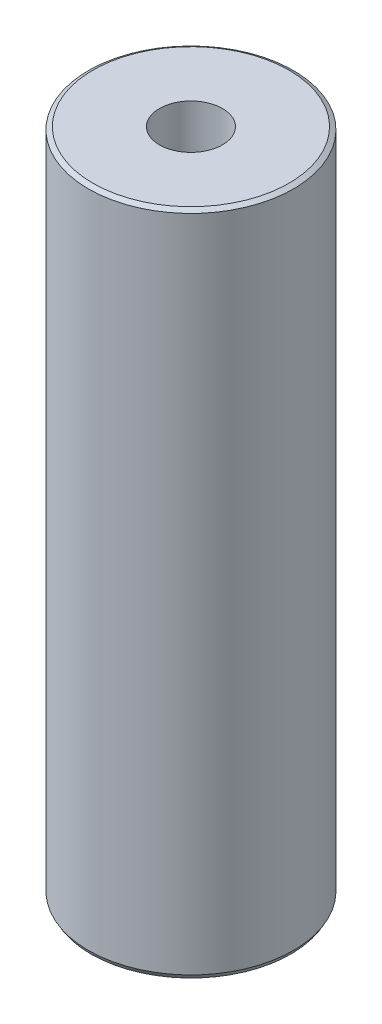
ISO-10303-21;
HEADER;
FILE_DESCRIPTION(('STEP AP214'),'2;1');
FILE_NAME('part.step','',(''),(''),'','','');
FILE_SCHEMA(('AUTOMOTIVE_DESIGN { 1 0 10303 214 1 1 1 1 }'));
ENDSEC;
DATA;
#1=APPLICATION_CONTEXT('core data for automotive mechanical design processes');
#2=APPLICATION_PROTOCOL_DEFINITION('international standard','automotive_design',2000,#1);
#3=PRODUCT_CONTEXT('',#1,'mechanical');
#4=PRODUCT('Part','Part','',(#3));
#5=PRODUCT_RELATED_PRODUCT_CATEGORY('part','',(#4));
#6=PRODUCT_DEFINITION_FORMATION('','',#4);
#7=PRODUCT_DEFINITION_CONTEXT('part definition',#1,'design');
#8=PRODUCT_DEFINITION('design','',#6,#7);
#9=PRODUCT_DEFINITION_SHAPE('','',#8);
#10=(LENGTH_UNIT() NAMED_UNIT(*) SI_UNIT(.MILLI.,.METRE.));
#11=(NAMED_UNIT(*) PLANE_ANGLE_UNIT() SI_UNIT($,.RADIAN.));
#12=(NAMED_UNIT(*) SI_UNIT($,.STERADIAN.) SOLID_ANGLE_UNIT());
#13=UNCERTAINTY_MEASURE_WITH_UNIT(LENGTH_MEASURE(1.E-05),#10,'distance_accuracy_value','');
#14=(GEOMETRIC_REPRESENTATION_CONTEXT(3) GLOBAL_UNCERTAINTY_ASSIGNED_CONTEXT((#13)) GLOBAL_UNIT_ASSIGNED_CONTEXT((#10,
#11,#12)) REPRESENTATION_CONTEXT('',''));
#15=CARTESIAN_POINT('',(0.,0.,0.));
#16=DIRECTION('',(0.,0.,1.));
#17=DIRECTION('',(1.,0.,0.));
#18=AXIS2_PLACEMENT_3D('',#15,#16,#17);
#19=CARTESIAN_POINT('',(0.,373.817596217918,0.));
#20=DIRECTION('',(0.,-1.,0.));
#21=DIRECTION('',(0.,0.,-1.));
#22=AXIS2_PLACEMENT_3D('',#19,#20,#21);
#23=CYLINDRICAL_SURFACE('',#22,57.5);
#24=CARTESIAN_POINT('',(0.,372.342375010247,0.));
#25=DIRECTION('',(0.,1.,0.));
#26=DIRECTION('',(0.,0.,1.));
#27=AXIS2_PLACEMENT_3D('',#24,#25,#26);
#28=CIRCLE('',#27,57.5);
#29=CARTESIAN_POINT('',(0.,372.342375010247,57.5));
#30=VERTEX_POINT('',#29);
#31=EDGE_CURVE('E50',#30,#30,#28,.F.);
#32=ORIENTED_EDGE('',*,*,#31,.T.);
#33=EDGE_LOOP('',(#32));
#34=FACE_BOUND('',#33,.T.);
#35=CARTESIAN_POINT('',(0.,2.53860821486557,0.));
#36=DIRECTION('',(0.,1.,0.));
#37=DIRECTION('',(0.,0.,1.));
#38=AXIS2_PLACEMENT_3D('',#35,#36,#37);
#39=CIRCLE('',#38,57.5);
#40=CARTESIAN_POINT('',(0.,2.53860821486557,57.5));
#41=VERTEX_POINT('',#40);
#42=EDGE_CURVE('E51',#41,#41,#39,.T.);
#43=ORIENTED_EDGE('',*,*,#42,.T.);
#44=EDGE_LOOP('',(#43));
#45=FACE_BOUND('',#44,.T.);
#46=ADVANCED_FACE('F39',(#34,#45),#23,.T.);
#47=CARTESIAN_POINT('',(0.,373.817596217918,0.));
#48=DIRECTION('',(0.,1.,0.));
#49=DIRECTION('',(0.,0.,1.));
#50=AXIS2_PLACEMENT_3D('',#47,#48,#49);
#51=PLANE('',#50);
#52=CARTESIAN_POINT('',(0.,373.817596217918,0.));
#53=DIRECTION('',(0.,1.,0.));
#54=DIRECTION('',(0.,0.,1.));
#55=AXIS2_PLACEMENT_3D('',#52,#53,#54);
#56=CIRCLE('',#55,54.9613917851344);
#57=CARTESIAN_POINT('',(0.,373.817596217918,54.9613917851344));
#58=VERTEX_POINT('',#57);
#59=EDGE_CURVE('E54',#58,#58,#56,.T.);
#60=ORIENTED_EDGE('',*,*,#59,.T.);
#61=EDGE_LOOP('',(#60));
#62=FACE_BOUND('',#61,.T.);
#63=CARTESIAN_POINT('',(0.,373.817596217918,0.));
#64=DIRECTION('',(0.,1.,0.));
#65=DIRECTION('',(0.,0.,1.));
#66=AXIS2_PLACEMENT_3D('',#63,#64,#65);
#67=CIRCLE('',#66,17.6762777401789);
#68=CARTESIAN_POINT('',(0.,373.817596217918,17.6762777401789));
#69=VERTEX_POINT('',#68);
#70=EDGE_CURVE('E58',#69,#69,#67,.T.);
#71=ORIENTED_EDGE('',*,*,#70,.F.);
#72=EDGE_LOOP('',(#71));
#73=FACE_BOUND('',#72,.T.);
#74=ADVANCED_FACE('F69',(#62,#73),#51,.T.);
#75=CARTESIAN_POINT('',(0.,0.,0.));
#76=DIRECTION('',(0.,1.,0.));
#77=DIRECTION('',(0.,0.,1.));
#78=AXIS2_PLACEMENT_3D('',#75,#76,#77);
#79=PLANE('',#78);
#80=CARTESIAN_POINT('',(0.,0.,0.));
#81=DIRECTION('',(0.,1.,0.));
#82=DIRECTION('',(0.,0.,1.));
#83=AXIS2_PLACEMENT_3D('',#80,#81,#82);
#84=CIRCLE('',#83,56.024778792329);
#85=CARTESIAN_POINT('',(0.,0.,56.024778792329));
#86=VERTEX_POINT('',#85);
#87=EDGE_CURVE('E10',#86,#86,#84,.F.);
#88=ORIENTED_EDGE('',*,*,#87,.T.);
#89=EDGE_LOOP('',(#88));
#90=FACE_BOUND('',#89,.T.);
#91=CARTESIAN_POINT('',(0.,0.,0.));
#92=DIRECTION('',(0.,1.,0.));
#93=DIRECTION('',(0.,0.,1.));
#94=AXIS2_PLACEMENT_3D('',#91,#92,#93);
#95=CIRCLE('',#94,17.6762777401789);
#96=CARTESIAN_POINT('',(0.,0.,17.6762777401789));
#97=VERTEX_POINT('',#96);
#98=EDGE_CURVE('E63',#97,#97,#95,.T.);
#99=ORIENTED_EDGE('',*,*,#98,.T.);
#100=EDGE_LOOP('',(#99));
#101=FACE_BOUND('',#100,.T.);
#102=ADVANCED_FACE('F75',(#90,#101),#79,.F.);
#103=CARTESIAN_POINT('',(0.,373.817596217918,0.));
#104=DIRECTION('',(0.,-1.,0.));
#105=DIRECTION('',(0.,0.,-1.));
#106=AXIS2_PLACEMENT_3D('',#103,#104,#105);
#107=CYLINDRICAL_SURFACE('',#106,17.6762777401789);
#108=ORIENTED_EDGE('',*,*,#70,.T.);
#109=EDGE_LOOP('',(#108));
#110=FACE_BOUND('',#109,.T.);
#111=ORIENTED_EDGE('',*,*,#98,.F.);
#112=EDGE_LOOP('',(#111));
#113=FACE_BOUND('',#112,.T.);
#114=ADVANCED_FACE('F70',(#110,#113),#107,.F.);
#115=CARTESIAN_POINT('',(0.,373.817596217918,0.));
#116=DIRECTION('',(0.,-1.,0.));
#117=DIRECTION('',(0.,0.,-1.));
#118=AXIS2_PLACEMENT_3D('',#115,#116,#117);
#119=CONICAL_SURFACE('',#118,54.9613917851344,1.04437922584664);
#120=ORIENTED_EDGE('',*,*,#31,.F.);
#121=EDGE_LOOP('',(#120));
#122=FACE_BOUND('',#121,.T.);
#123=ORIENTED_EDGE('',*,*,#59,.F.);
#124=EDGE_LOOP('',(#123));
#125=FACE_BOUND('',#124,.T.);
#126=ADVANCED_FACE('F81',(#122,#125),#119,.T.);
#127=CARTESIAN_POINT('',(0.,2.53860821486557,0.));
#128=DIRECTION('',(0.,1.,0.));
#129=DIRECTION('',(0.,0.,1.));
#130=AXIS2_PLACEMENT_3D('',#127,#128,#129);
#131=CONICAL_SURFACE('',#130,57.5,0.526417100948277);
#132=ORIENTED_EDGE('',*,*,#87,.F.);
#133=EDGE_LOOP('',(#132));
#134=FACE_BOUND('',#133,.T.);
#135=ORIENTED_EDGE('',*,*,#42,.F.);
#136=EDGE_LOOP('',(#135));
#137=FACE_BOUND('',#136,.T.);
#138=ADVANCED_FACE('F45',(#134,#137),#131,.T.);
#139=CLOSED_SHELL('',(#46,#74,#102,#114,#126,#138));
#140=MANIFOLD_SOLID_BREP('B2',#139);
#141=ADVANCED_BREP_SHAPE_REPRESENTATION('',(#18,#140),#14);
#142=SHAPE_DEFINITION_REPRESENTATION(#9,#141);
ENDSEC;
END-ISO-10303-21;
